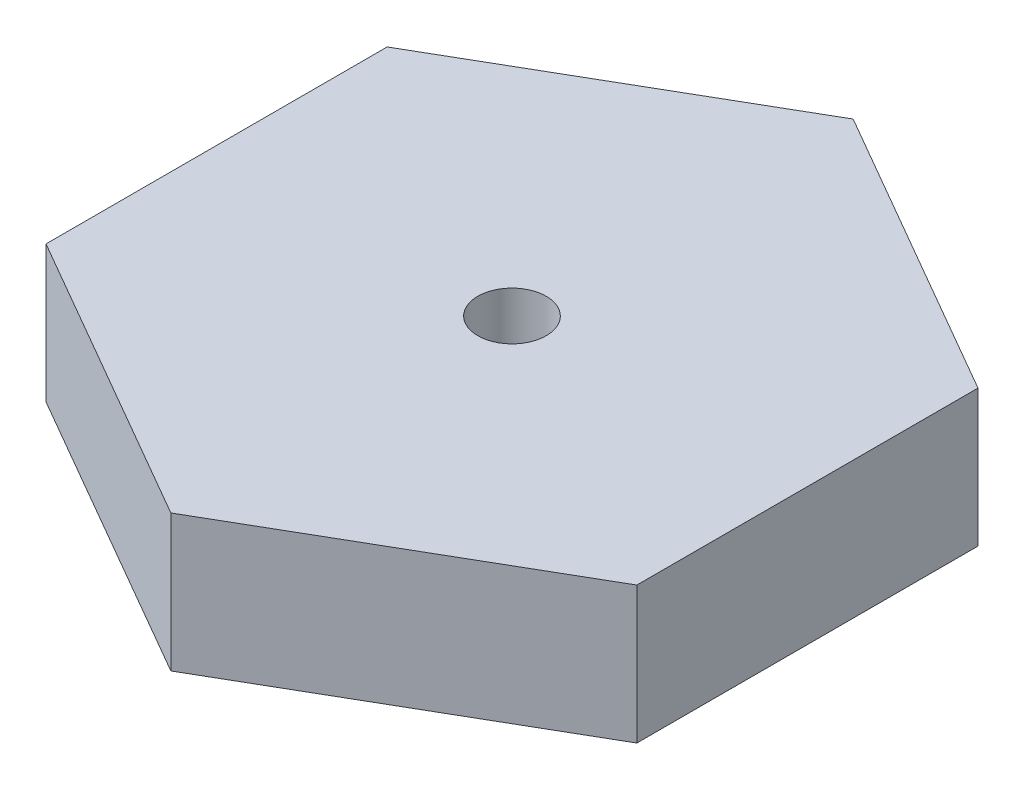
ISO-10303-21;
HEADER;
FILE_DESCRIPTION(('STEP AP214'),'2;1');
FILE_NAME('part.step','',(''),(''),'','','');
FILE_SCHEMA(('AUTOMOTIVE_DESIGN { 1 0 10303 214 1 1 1 1 }'));
ENDSEC;
DATA;
#1=APPLICATION_CONTEXT('core data for automotive mechanical design processes');
#2=APPLICATION_PROTOCOL_DEFINITION('international standard','automotive_design',2000,#1);
#3=PRODUCT_CONTEXT('',#1,'mechanical');
#4=PRODUCT('Part','Part','',(#3));
#5=PRODUCT_RELATED_PRODUCT_CATEGORY('part','',(#4));
#6=PRODUCT_DEFINITION_FORMATION('','',#4);
#7=PRODUCT_DEFINITION_CONTEXT('part definition',#1,'design');
#8=PRODUCT_DEFINITION('design','',#6,#7);
#9=PRODUCT_DEFINITION_SHAPE('','',#8);
#10=(LENGTH_UNIT() NAMED_UNIT(*) SI_UNIT(.MILLI.,.METRE.));
#11=(NAMED_UNIT(*) PLANE_ANGLE_UNIT() SI_UNIT($,.RADIAN.));
#12=(NAMED_UNIT(*) SI_UNIT($,.STERADIAN.) SOLID_ANGLE_UNIT());
#13=UNCERTAINTY_MEASURE_WITH_UNIT(LENGTH_MEASURE(1.E-05),#10,'distance_accuracy_value','');
#14=(GEOMETRIC_REPRESENTATION_CONTEXT(3) GLOBAL_UNCERTAINTY_ASSIGNED_CONTEXT((#13)) GLOBAL_UNIT_ASSIGNED_CONTEXT((#10,
#11,#12)) REPRESENTATION_CONTEXT('',''));
#15=CARTESIAN_POINT('',(0.,0.,0.));
#16=DIRECTION('',(0.,0.,1.));
#17=DIRECTION('',(1.,0.,0.));
#18=AXIS2_PLACEMENT_3D('',#15,#16,#17);
#19=CARTESIAN_POINT('',(0.,5.08,0.));
#20=DIRECTION('',(0.,1.,0.));
#21=DIRECTION('',(0.,0.,1.));
#22=AXIS2_PLACEMENT_3D('',#19,#20,#21);
#23=PLANE('',#22);
#24=DIRECTION('',(-0.866025403784441,0.,-0.499999999999995));
#25=VECTOR('',#24,1.);
#26=CARTESIAN_POINT('',(10.9663515230525,5.08,-6.33142600386261));
#27=LINE('',#26,#25);
#28=CARTESIAN_POINT('',(10.9663515230525,5.08,-6.33142600386261));
#29=VERTEX_POINT('',#28);
#30=CARTESIAN_POINT('',(0.,5.08,-12.662852007725));
#31=VERTEX_POINT('',#30);
#32=EDGE_CURVE('E129',#29,#31,#27,.T.);
#33=ORIENTED_EDGE('',*,*,#32,.T.);
#34=DIRECTION('',(-0.866025403784438,0.,0.500000000000001));
#35=VECTOR('',#34,1.);
#36=CARTESIAN_POINT('',(0.,5.08,-12.662852007725));
#37=LINE('',#36,#35);
#38=CARTESIAN_POINT('',(-10.9663515230526,5.08,-6.33142600386246));
#39=VERTEX_POINT('',#38);
#40=EDGE_CURVE('E87',#31,#39,#37,.T.);
#41=ORIENTED_EDGE('',*,*,#40,.T.);
#42=DIRECTION('',(0.,0.,1.));
#43=VECTOR('',#42,1.);
#44=CARTESIAN_POINT('',(-10.9663515230526,5.08,-6.33142600386246));
#45=LINE('',#44,#43);
#46=CARTESIAN_POINT('',(-10.9663515230526,5.08,6.33142600386253));
#47=VERTEX_POINT('',#46);
#48=EDGE_CURVE('E100',#39,#47,#45,.T.);
#49=ORIENTED_EDGE('',*,*,#48,.T.);
#50=DIRECTION('',(0.866025403784441,0.,0.499999999999995));
#51=VECTOR('',#50,1.);
#52=CARTESIAN_POINT('',(-10.9663515230526,5.08,6.33142600386253));
#53=LINE('',#52,#51);
#54=CARTESIAN_POINT('',(0.,5.08,12.662852007725));
#55=VERTEX_POINT('',#54);
#56=EDGE_CURVE('E94',#47,#55,#53,.T.);
#57=ORIENTED_EDGE('',*,*,#56,.T.);
#58=DIRECTION('',(0.866025403784434,0.,-0.500000000000007));
#59=VECTOR('',#58,1.);
#60=CARTESIAN_POINT('',(0.,5.08,12.662852007725));
#61=LINE('',#60,#59);
#62=CARTESIAN_POINT('',(10.9663515230527,5.08,6.33142600386238));
#63=VERTEX_POINT('',#62);
#64=EDGE_CURVE('E98',#55,#63,#61,.T.);
#65=ORIENTED_EDGE('',*,*,#64,.T.);
#66=DIRECTION('',(0.,0.,-1.));
#67=VECTOR('',#66,1.);
#68=CARTESIAN_POINT('',(10.9663515230527,5.08,6.33142600386238));
#69=LINE('',#68,#67);
#70=EDGE_CURVE('E50',#63,#29,#69,.T.);
#71=ORIENTED_EDGE('',*,*,#70,.T.);
#72=EDGE_LOOP('',(#33,#41,#49,#57,#65,#71));
#73=FACE_BOUND('',#72,.T.);
#74=CARTESIAN_POINT('',(0.,5.08,0.));
#75=DIRECTION('',(0.,1.,0.));
#76=DIRECTION('',(0.,0.,1.));
#77=AXIS2_PLACEMENT_3D('',#74,#75,#76);
#78=CIRCLE('',#77,1.27);
#79=CARTESIAN_POINT('',(0.,5.08,1.27));
#80=VERTEX_POINT('',#79);
#81=EDGE_CURVE('E122',#80,#80,#78,.T.);
#82=ORIENTED_EDGE('',*,*,#81,.F.);
#83=EDGE_LOOP('',(#82));
#84=FACE_BOUND('',#83,.T.);
#85=ADVANCED_FACE('F33',(#73,#84),#23,.T.);
#86=CARTESIAN_POINT('',(0.,0.,0.));
#87=DIRECTION('',(0.,1.,0.));
#88=DIRECTION('',(0.,0.,1.));
#89=AXIS2_PLACEMENT_3D('',#86,#87,#88);
#90=PLANE('',#89);
#91=DIRECTION('',(-0.866025403784441,0.,-0.499999999999995));
#92=VECTOR('',#91,1.);
#93=CARTESIAN_POINT('',(10.9663515230525,0.,-6.33142600386261));
#94=LINE('',#93,#92);
#95=CARTESIAN_POINT('',(10.9663515230525,0.,-6.33142600386261));
#96=VERTEX_POINT('',#95);
#97=CARTESIAN_POINT('',(0.,0.,-12.662852007725));
#98=VERTEX_POINT('',#97);
#99=EDGE_CURVE('E118',#96,#98,#94,.T.);
#100=ORIENTED_EDGE('',*,*,#99,.F.);
#101=DIRECTION('',(0.,0.,-1.));
#102=VECTOR('',#101,1.);
#103=CARTESIAN_POINT('',(10.9663515230527,0.,6.33142600386238));
#104=LINE('',#103,#102);
#105=CARTESIAN_POINT('',(10.9663515230527,0.,6.33142600386238));
#106=VERTEX_POINT('',#105);
#107=EDGE_CURVE('E79',#106,#96,#104,.T.);
#108=ORIENTED_EDGE('',*,*,#107,.F.);
#109=DIRECTION('',(0.866025403784434,0.,-0.500000000000007));
#110=VECTOR('',#109,1.);
#111=CARTESIAN_POINT('',(0.,0.,12.662852007725));
#112=LINE('',#111,#110);
#113=CARTESIAN_POINT('',(0.,0.,12.662852007725));
#114=VERTEX_POINT('',#113);
#115=EDGE_CURVE('E73',#114,#106,#112,.T.);
#116=ORIENTED_EDGE('',*,*,#115,.F.);
#117=DIRECTION('',(0.866025403784441,0.,0.499999999999995));
#118=VECTOR('',#117,1.);
#119=CARTESIAN_POINT('',(-10.9663515230526,0.,6.33142600386253));
#120=LINE('',#119,#118);
#121=CARTESIAN_POINT('',(-10.9663515230526,0.,6.33142600386253));
#122=VERTEX_POINT('',#121);
#123=EDGE_CURVE('E108',#122,#114,#120,.T.);
#124=ORIENTED_EDGE('',*,*,#123,.F.);
#125=DIRECTION('',(0.,0.,1.));
#126=VECTOR('',#125,1.);
#127=CARTESIAN_POINT('',(-10.9663515230526,0.,-6.33142600386246));
#128=LINE('',#127,#126);
#129=CARTESIAN_POINT('',(-10.9663515230526,0.,-6.33142600386246));
#130=VERTEX_POINT('',#129);
#131=EDGE_CURVE('E124',#130,#122,#128,.T.);
#132=ORIENTED_EDGE('',*,*,#131,.F.);
#133=DIRECTION('',(-0.866025403784438,0.,0.500000000000001));
#134=VECTOR('',#133,1.);
#135=CARTESIAN_POINT('',(0.,0.,-12.662852007725));
#136=LINE('',#135,#134);
#137=EDGE_CURVE('E121',#98,#130,#136,.T.);
#138=ORIENTED_EDGE('',*,*,#137,.F.);
#139=EDGE_LOOP('',(#100,#108,#116,#124,#132,#138));
#140=FACE_BOUND('',#139,.T.);
#141=CARTESIAN_POINT('',(0.,0.,0.));
#142=DIRECTION('',(0.,1.,0.));
#143=DIRECTION('',(0.,0.,1.));
#144=AXIS2_PLACEMENT_3D('',#141,#142,#143);
#145=CIRCLE('',#144,1.27);
#146=CARTESIAN_POINT('',(0.,0.,1.27));
#147=VERTEX_POINT('',#146);
#148=EDGE_CURVE('E228',#147,#147,#145,.T.);
#149=ORIENTED_EDGE('',*,*,#148,.T.);
#150=EDGE_LOOP('',(#149));
#151=FACE_BOUND('',#150,.T.);
#152=ADVANCED_FACE('F138',(#140,#151),#90,.F.);
#153=CARTESIAN_POINT('',(10.9663515230525,5.08,-6.33142600386261));
#154=DIRECTION('',(-0.499999999999995,0.,0.866025403784442));
#155=DIRECTION('',(0.866025403784442,0.,0.499999999999995));
#156=AXIS2_PLACEMENT_3D('',#153,#154,#155);
#157=PLANE('',#156);
#158=ORIENTED_EDGE('',*,*,#99,.T.);
#159=DIRECTION('',(0.,-1.,0.));
#160=VECTOR('',#159,1.);
#161=CARTESIAN_POINT('',(0.,5.08,-12.662852007725));
#162=LINE('',#161,#160);
#163=EDGE_CURVE('E11',#31,#98,#162,.T.);
#164=ORIENTED_EDGE('',*,*,#163,.F.);
#165=ORIENTED_EDGE('',*,*,#32,.F.);
#166=DIRECTION('',(0.,-1.,0.));
#167=VECTOR('',#166,1.);
#168=CARTESIAN_POINT('',(10.9663515230525,5.08,-6.33142600386261));
#169=LINE('',#168,#167);
#170=EDGE_CURVE('E114',#29,#96,#169,.T.);
#171=ORIENTED_EDGE('',*,*,#170,.T.);
#172=EDGE_LOOP('',(#158,#164,#165,#171));
#173=FACE_BOUND('',#172,.T.);
#174=ADVANCED_FACE('F35',(#173),#157,.F.);
#175=CARTESIAN_POINT('',(0.,5.08,-12.662852007725));
#176=DIRECTION('',(0.500000000000001,0.,0.866025403784438));
#177=DIRECTION('',(0.866025403784438,0.,-0.500000000000001));
#178=AXIS2_PLACEMENT_3D('',#175,#176,#177);
#179=PLANE('',#178);
#180=ORIENTED_EDGE('',*,*,#137,.T.);
#181=DIRECTION('',(0.,-1.,0.));
#182=VECTOR('',#181,1.);
#183=CARTESIAN_POINT('',(-10.9663515230526,5.08,-6.33142600386246));
#184=LINE('',#183,#182);
#185=EDGE_CURVE('E42',#39,#130,#184,.T.);
#186=ORIENTED_EDGE('',*,*,#185,.F.);
#187=ORIENTED_EDGE('',*,*,#40,.F.);
#188=ORIENTED_EDGE('',*,*,#163,.T.);
#189=EDGE_LOOP('',(#180,#186,#187,#188));
#190=FACE_BOUND('',#189,.T.);
#191=ADVANCED_FACE('F163',(#190),#179,.F.);
#192=CARTESIAN_POINT('',(-10.9663515230526,5.08,-6.33142600386246));
#193=DIRECTION('',(1.,0.,0.));
#194=DIRECTION('',(0.,0.,-1.));
#195=AXIS2_PLACEMENT_3D('',#192,#193,#194);
#196=PLANE('',#195);
#197=ORIENTED_EDGE('',*,*,#131,.T.);
#198=DIRECTION('',(0.,-1.,0.));
#199=VECTOR('',#198,1.);
#200=CARTESIAN_POINT('',(-10.9663515230526,5.08,6.33142600386253));
#201=LINE('',#200,#199);
#202=EDGE_CURVE('E109',#47,#122,#201,.T.);
#203=ORIENTED_EDGE('',*,*,#202,.F.);
#204=ORIENTED_EDGE('',*,*,#48,.F.);
#205=ORIENTED_EDGE('',*,*,#185,.T.);
#206=EDGE_LOOP('',(#197,#203,#204,#205));
#207=FACE_BOUND('',#206,.T.);
#208=ADVANCED_FACE('F135',(#207),#196,.F.);
#209=CARTESIAN_POINT('',(-10.9663515230526,5.08,6.33142600386253));
#210=DIRECTION('',(0.499999999999995,0.,-0.866025403784442));
#211=DIRECTION('',(-0.866025403784442,0.,-0.499999999999995));
#212=AXIS2_PLACEMENT_3D('',#209,#210,#211);
#213=PLANE('',#212);
#214=ORIENTED_EDGE('',*,*,#123,.T.);
#215=DIRECTION('',(0.,-1.,0.));
#216=VECTOR('',#215,1.);
#217=CARTESIAN_POINT('',(0.,5.08,12.662852007725));
#218=LINE('',#217,#216);
#219=EDGE_CURVE('E105',#55,#114,#218,.T.);
#220=ORIENTED_EDGE('',*,*,#219,.F.);
#221=ORIENTED_EDGE('',*,*,#56,.F.);
#222=ORIENTED_EDGE('',*,*,#202,.T.);
#223=EDGE_LOOP('',(#214,#220,#221,#222));
#224=FACE_BOUND('',#223,.T.);
#225=ADVANCED_FACE('F106',(#224),#213,.F.);
#226=CARTESIAN_POINT('',(0.,5.08,12.662852007725));
#227=DIRECTION('',(-0.500000000000007,0.,-0.866025403784434));
#228=DIRECTION('',(-0.866025403784435,0.,0.500000000000007));
#229=AXIS2_PLACEMENT_3D('',#226,#227,#228);
#230=PLANE('',#229);
#231=ORIENTED_EDGE('',*,*,#115,.T.);
#232=DIRECTION('',(0.,-1.,0.));
#233=VECTOR('',#232,1.);
#234=CARTESIAN_POINT('',(10.9663515230527,5.08,6.33142600386238));
#235=LINE('',#234,#233);
#236=EDGE_CURVE('E110',#63,#106,#235,.T.);
#237=ORIENTED_EDGE('',*,*,#236,.F.);
#238=ORIENTED_EDGE('',*,*,#64,.F.);
#239=ORIENTED_EDGE('',*,*,#219,.T.);
#240=EDGE_LOOP('',(#231,#237,#238,#239));
#241=FACE_BOUND('',#240,.T.);
#242=ADVANCED_FACE('F112',(#241),#230,.F.);
#243=CARTESIAN_POINT('',(10.9663515230527,5.08,6.33142600386238));
#244=DIRECTION('',(-1.,0.,0.));
#245=DIRECTION('',(0.,0.,1.));
#246=AXIS2_PLACEMENT_3D('',#243,#244,#245);
#247=PLANE('',#246);
#248=ORIENTED_EDGE('',*,*,#107,.T.);
#249=ORIENTED_EDGE('',*,*,#170,.F.);
#250=ORIENTED_EDGE('',*,*,#70,.F.);
#251=ORIENTED_EDGE('',*,*,#236,.T.);
#252=EDGE_LOOP('',(#248,#249,#250,#251));
#253=FACE_BOUND('',#252,.T.);
#254=ADVANCED_FACE('F143',(#253),#247,.F.);
#255=CARTESIAN_POINT('',(0.,5.08,0.));
#256=DIRECTION('',(0.,-1.,0.));
#257=DIRECTION('',(0.,0.,-1.));
#258=AXIS2_PLACEMENT_3D('',#255,#256,#257);
#259=CYLINDRICAL_SURFACE('',#258,1.27);
#260=ORIENTED_EDGE('',*,*,#81,.T.);
#261=EDGE_LOOP('',(#260));
#262=FACE_BOUND('',#261,.T.);
#263=ORIENTED_EDGE('',*,*,#148,.F.);
#264=EDGE_LOOP('',(#263));
#265=FACE_BOUND('',#264,.T.);
#266=ADVANCED_FACE('F145',(#262,#265),#259,.F.);
#267=CLOSED_SHELL('',(#85,#152,#174,#191,#208,#225,#242,#254,#266));
#268=MANIFOLD_SOLID_BREP('B2',#267);
#269=ADVANCED_BREP_SHAPE_REPRESENTATION('',(#18,#268),#14);
#270=SHAPE_DEFINITION_REPRESENTATION(#9,#269);
ENDSEC;
END-ISO-10303-21;
